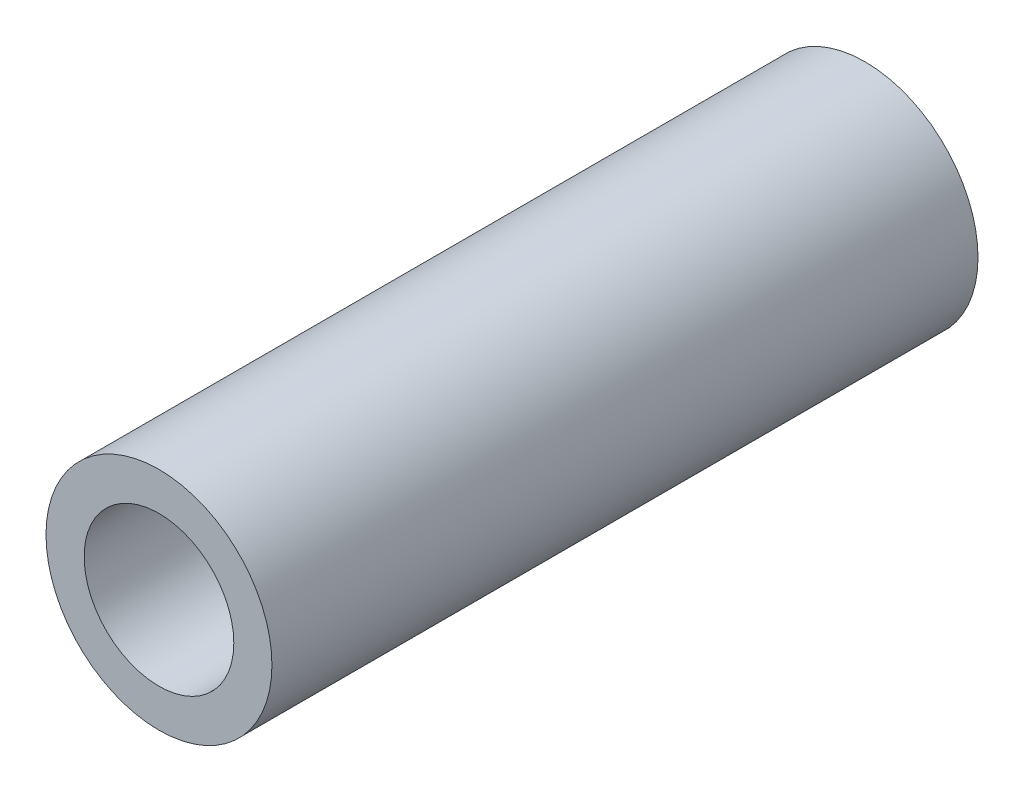
ISO-10303-21;
HEADER;
FILE_DESCRIPTION(('STEP AP214'),'2;1');
FILE_NAME('part.step','',(''),(''),'','','');
FILE_SCHEMA(('AUTOMOTIVE_DESIGN { 1 0 10303 214 1 1 1 1 }'));
ENDSEC;
DATA;
#1=APPLICATION_CONTEXT('core data for automotive mechanical design processes');
#2=APPLICATION_PROTOCOL_DEFINITION('international standard','automotive_design',2000,#1);
#3=PRODUCT_CONTEXT('',#1,'mechanical');
#4=PRODUCT('Part','Part','',(#3));
#5=PRODUCT_RELATED_PRODUCT_CATEGORY('part','',(#4));
#6=PRODUCT_DEFINITION_FORMATION('','',#4);
#7=PRODUCT_DEFINITION_CONTEXT('part definition',#1,'design');
#8=PRODUCT_DEFINITION('design','',#6,#7);
#9=PRODUCT_DEFINITION_SHAPE('','',#8);
#10=(LENGTH_UNIT() NAMED_UNIT(*) SI_UNIT(.MILLI.,.METRE.));
#11=(NAMED_UNIT(*) PLANE_ANGLE_UNIT() SI_UNIT($,.RADIAN.));
#12=(NAMED_UNIT(*) SI_UNIT($,.STERADIAN.) SOLID_ANGLE_UNIT());
#13=UNCERTAINTY_MEASURE_WITH_UNIT(LENGTH_MEASURE(1.E-05),#10,'distance_accuracy_value','');
#14=(GEOMETRIC_REPRESENTATION_CONTEXT(3) GLOBAL_UNCERTAINTY_ASSIGNED_CONTEXT((#13)) GLOBAL_UNIT_ASSIGNED_CONTEXT((#10,
#11,#12)) REPRESENTATION_CONTEXT('',''));
#15=CARTESIAN_POINT('',(0.,0.,0.));
#16=DIRECTION('',(0.,0.,1.));
#17=DIRECTION('',(1.,0.,0.));
#18=AXIS2_PLACEMENT_3D('',#15,#16,#17);
#19=CARTESIAN_POINT('',(0.,0.,12.5));
#20=DIRECTION('',(0.,0.,1.));
#21=DIRECTION('',(1.,0.,0.));
#22=AXIS2_PLACEMENT_3D('',#19,#20,#21);
#23=PLANE('',#22);
#24=CARTESIAN_POINT('',(0.,0.,12.5));
#25=DIRECTION('',(0.,0.,1.));
#26=DIRECTION('',(1.,0.,0.));
#27=AXIS2_PLACEMENT_3D('',#24,#25,#26);
#28=CIRCLE('',#27,4.);
#29=CARTESIAN_POINT('',(4.,0.,12.5));
#30=VERTEX_POINT('',#29);
#31=EDGE_CURVE('E10',#30,#30,#28,.T.);
#32=ORIENTED_EDGE('',*,*,#31,.T.);
#33=EDGE_LOOP('',(#32));
#34=FACE_BOUND('',#33,.T.);
#35=CARTESIAN_POINT('',(0.,0.,12.5));
#36=DIRECTION('',(0.,0.,1.));
#37=DIRECTION('',(1.,0.,0.));
#38=AXIS2_PLACEMENT_3D('',#35,#36,#37);
#39=CIRCLE('',#38,2.65);
#40=CARTESIAN_POINT('',(2.65,0.,12.5));
#41=VERTEX_POINT('',#40);
#42=EDGE_CURVE('E41',#41,#41,#39,.T.);
#43=ORIENTED_EDGE('',*,*,#42,.F.);
#44=EDGE_LOOP('',(#43));
#45=FACE_BOUND('',#44,.T.);
#46=ADVANCED_FACE('F30',(#34,#45),#23,.T.);
#47=CARTESIAN_POINT('',(0.,0.,-12.5));
#48=DIRECTION('',(0.,0.,1.));
#49=DIRECTION('',(1.,0.,0.));
#50=AXIS2_PLACEMENT_3D('',#47,#48,#49);
#51=PLANE('',#50);
#52=CARTESIAN_POINT('',(0.,0.,-12.5));
#53=DIRECTION('',(0.,0.,1.));
#54=DIRECTION('',(1.,0.,0.));
#55=AXIS2_PLACEMENT_3D('',#52,#53,#54);
#56=CIRCLE('',#55,4.);
#57=CARTESIAN_POINT('',(4.,0.,-12.5));
#58=VERTEX_POINT('',#57);
#59=EDGE_CURVE('E34',#58,#58,#56,.T.);
#60=ORIENTED_EDGE('',*,*,#59,.F.);
#61=EDGE_LOOP('',(#60));
#62=FACE_BOUND('',#61,.T.);
#63=CARTESIAN_POINT('',(0.,0.,-12.5));
#64=DIRECTION('',(0.,0.,1.));
#65=DIRECTION('',(1.,0.,0.));
#66=AXIS2_PLACEMENT_3D('',#63,#64,#65);
#67=CIRCLE('',#66,2.65);
#68=CARTESIAN_POINT('',(2.65,0.,-12.5));
#69=VERTEX_POINT('',#68);
#70=EDGE_CURVE('E43',#69,#69,#67,.T.);
#71=ORIENTED_EDGE('',*,*,#70,.T.);
#72=EDGE_LOOP('',(#71));
#73=FACE_BOUND('',#72,.T.);
#74=ADVANCED_FACE('F53',(#62,#73),#51,.F.);
#75=CARTESIAN_POINT('',(0.,0.,12.5));
#76=DIRECTION('',(0.,0.,-1.));
#77=DIRECTION('',(-1.,0.,0.));
#78=AXIS2_PLACEMENT_3D('',#75,#76,#77);
#79=CYLINDRICAL_SURFACE('',#78,4.);
#80=ORIENTED_EDGE('',*,*,#31,.F.);
#81=EDGE_LOOP('',(#80));
#82=FACE_BOUND('',#81,.T.);
#83=ORIENTED_EDGE('',*,*,#59,.T.);
#84=EDGE_LOOP('',(#83));
#85=FACE_BOUND('',#84,.T.);
#86=ADVANCED_FACE('F32',(#82,#85),#79,.T.);
#87=CARTESIAN_POINT('',(0.,0.,12.5));
#88=DIRECTION('',(0.,0.,-1.));
#89=DIRECTION('',(-1.,0.,0.));
#90=AXIS2_PLACEMENT_3D('',#87,#88,#89);
#91=CYLINDRICAL_SURFACE('',#90,2.65);
#92=ORIENTED_EDGE('',*,*,#42,.T.);
#93=EDGE_LOOP('',(#92));
#94=FACE_BOUND('',#93,.T.);
#95=ORIENTED_EDGE('',*,*,#70,.F.);
#96=EDGE_LOOP('',(#95));
#97=FACE_BOUND('',#96,.T.);
#98=ADVANCED_FACE('F49',(#94,#97),#91,.F.);
#99=CLOSED_SHELL('',(#46,#74,#86,#98));
#100=MANIFOLD_SOLID_BREP('B2',#99);
#101=ADVANCED_BREP_SHAPE_REPRESENTATION('',(#18,#100),#14);
#102=SHAPE_DEFINITION_REPRESENTATION(#9,#101);
ENDSEC;
END-ISO-10303-21;
